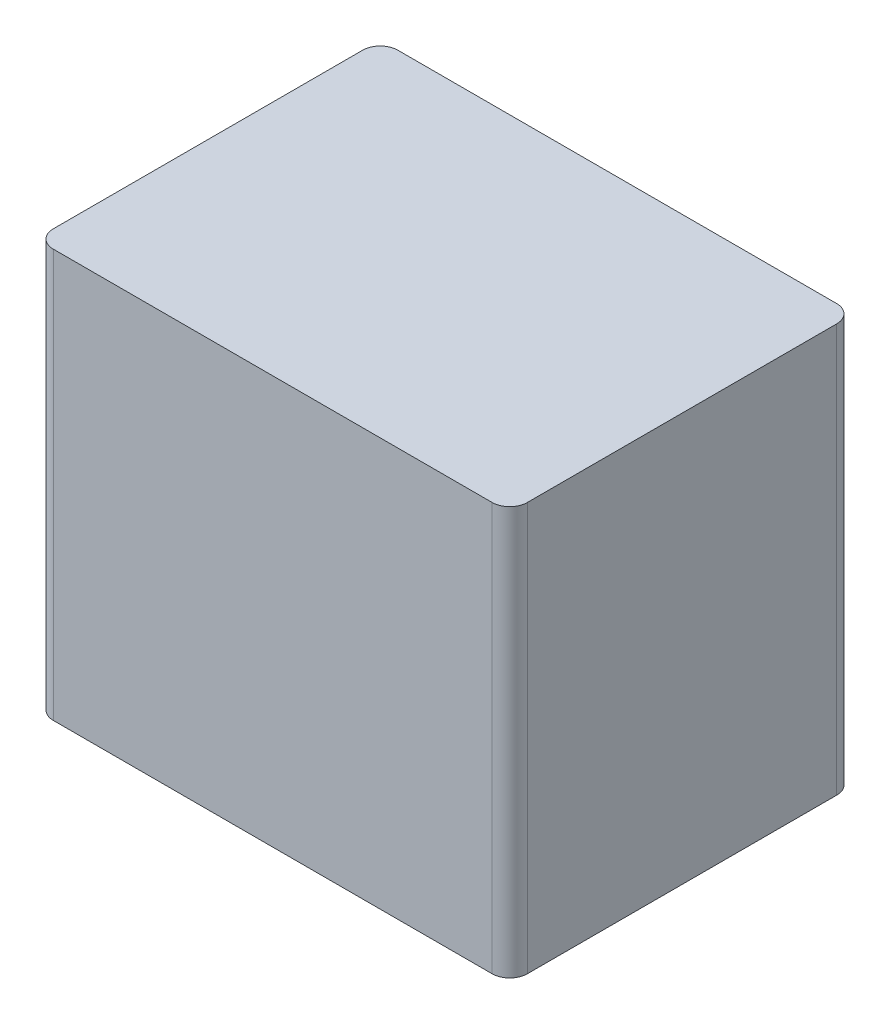
ISO-10303-21;
HEADER;
FILE_DESCRIPTION(('STEP AP214'),'2;1');
FILE_NAME('part.step','',(''),(''),'','','');
FILE_SCHEMA(('AUTOMOTIVE_DESIGN { 1 0 10303 214 1 1 1 1 }'));
ENDSEC;
DATA;
#1=APPLICATION_CONTEXT('core data for automotive mechanical design processes');
#2=APPLICATION_PROTOCOL_DEFINITION('international standard','automotive_design',2000,#1);
#3=PRODUCT_CONTEXT('',#1,'mechanical');
#4=PRODUCT('Part','Part','',(#3));
#5=PRODUCT_RELATED_PRODUCT_CATEGORY('part','',(#4));
#6=PRODUCT_DEFINITION_FORMATION('','',#4);
#7=PRODUCT_DEFINITION_CONTEXT('part definition',#1,'design');
#8=PRODUCT_DEFINITION('design','',#6,#7);
#9=PRODUCT_DEFINITION_SHAPE('','',#8);
#10=(LENGTH_UNIT() NAMED_UNIT(*) SI_UNIT(.MILLI.,.METRE.));
#11=(NAMED_UNIT(*) PLANE_ANGLE_UNIT() SI_UNIT($,.RADIAN.));
#12=(NAMED_UNIT(*) SI_UNIT($,.STERADIAN.) SOLID_ANGLE_UNIT());
#13=UNCERTAINTY_MEASURE_WITH_UNIT(LENGTH_MEASURE(1.E-05),#10,'distance_accuracy_value','');
#14=(GEOMETRIC_REPRESENTATION_CONTEXT(3) GLOBAL_UNCERTAINTY_ASSIGNED_CONTEXT((#13)) GLOBAL_UNIT_ASSIGNED_CONTEXT((#10,
#11,#12)) REPRESENTATION_CONTEXT('',''));
#15=CARTESIAN_POINT('',(0.,0.,0.));
#16=DIRECTION('',(0.,0.,1.));
#17=DIRECTION('',(1.,0.,0.));
#18=AXIS2_PLACEMENT_3D('',#15,#16,#17);
#19=CARTESIAN_POINT('',(0.,46.5,0.));
#20=DIRECTION('',(1.,0.,0.));
#21=DIRECTION('',(0.,0.,-1.));
#22=AXIS2_PLACEMENT_3D('',#19,#20,#21);
#23=PLANE('',#22);
#24=DIRECTION('',(0.,0.,1.));
#25=VECTOR('',#24,1.);
#26=CARTESIAN_POINT('',(0.,46.5,0.));
#27=LINE('',#26,#25);
#28=CARTESIAN_POINT('',(0.,46.5,-37.25));
#29=VERTEX_POINT('',#28);
#30=CARTESIAN_POINT('',(0.,46.5,-2.));
#31=VERTEX_POINT('',#30);
#32=EDGE_CURVE('E131',#29,#31,#27,.T.);
#33=ORIENTED_EDGE('',*,*,#32,.F.);
#34=DIRECTION('',(0.,-1.,0.));
#35=VECTOR('',#34,1.);
#36=CARTESIAN_POINT('',(0.,46.5,-37.25));
#37=LINE('',#36,#35);
#38=CARTESIAN_POINT('',(0.,0.,-37.25));
#39=VERTEX_POINT('',#38);
#40=EDGE_CURVE('E11',#29,#39,#37,.T.);
#41=ORIENTED_EDGE('',*,*,#40,.T.);
#42=DIRECTION('',(0.,0.,1.));
#43=VECTOR('',#42,1.);
#44=CARTESIAN_POINT('',(0.,0.,0.));
#45=LINE('',#44,#43);
#46=CARTESIAN_POINT('',(0.,0.,-2.));
#47=VERTEX_POINT('',#46);
#48=EDGE_CURVE('E122',#39,#47,#45,.T.);
#49=ORIENTED_EDGE('',*,*,#48,.T.);
#50=DIRECTION('',(0.,-1.,0.));
#51=VECTOR('',#50,1.);
#52=CARTESIAN_POINT('',(0.,46.5,-2.));
#53=LINE('',#52,#51);
#54=EDGE_CURVE('E107',#47,#31,#53,.F.);
#55=ORIENTED_EDGE('',*,*,#54,.T.);
#56=EDGE_LOOP('',(#33,#41,#49,#55));
#57=FACE_BOUND('',#56,.T.);
#58=ADVANCED_FACE('F33',(#57),#23,.F.);
#59=CARTESIAN_POINT('',(0.,46.5,0.));
#60=DIRECTION('',(0.,0.,-1.));
#61=DIRECTION('',(-1.,0.,0.));
#62=AXIS2_PLACEMENT_3D('',#59,#60,#61);
#63=PLANE('',#62);
#64=DIRECTION('',(1.,0.,0.));
#65=VECTOR('',#64,1.);
#66=CARTESIAN_POINT('',(0.,0.,0.));
#67=LINE('',#66,#65);
#68=CARTESIAN_POINT('',(2.,0.,0.));
#69=VERTEX_POINT('',#68);
#70=CARTESIAN_POINT('',(52.,0.,0.));
#71=VERTEX_POINT('',#70);
#72=EDGE_CURVE('E113',#69,#71,#67,.T.);
#73=ORIENTED_EDGE('',*,*,#72,.T.);
#74=DIRECTION('',(0.,-1.,0.));
#75=VECTOR('',#74,1.);
#76=CARTESIAN_POINT('',(52.,46.5,0.));
#77=LINE('',#76,#75);
#78=CARTESIAN_POINT('',(52.,46.5,0.));
#79=VERTEX_POINT('',#78);
#80=EDGE_CURVE('E41',#71,#79,#77,.F.);
#81=ORIENTED_EDGE('',*,*,#80,.T.);
#82=DIRECTION('',(1.,0.,0.));
#83=VECTOR('',#82,1.);
#84=CARTESIAN_POINT('',(0.,46.5,0.));
#85=LINE('',#84,#83);
#86=CARTESIAN_POINT('',(2.,46.5,0.));
#87=VERTEX_POINT('',#86);
#88=EDGE_CURVE('E114',#87,#79,#85,.T.);
#89=ORIENTED_EDGE('',*,*,#88,.F.);
#90=DIRECTION('',(0.,-1.,0.));
#91=VECTOR('',#90,1.);
#92=CARTESIAN_POINT('',(2.,46.5,0.));
#93=LINE('',#92,#91);
#94=EDGE_CURVE('E105',#87,#69,#93,.T.);
#95=ORIENTED_EDGE('',*,*,#94,.T.);
#96=EDGE_LOOP('',(#73,#81,#89,#95));
#97=FACE_BOUND('',#96,.T.);
#98=ADVANCED_FACE('F112',(#97),#63,.F.);
#99=CARTESIAN_POINT('',(54.,46.5,0.));
#100=DIRECTION('',(-1.,0.,0.));
#101=DIRECTION('',(0.,0.,1.));
#102=AXIS2_PLACEMENT_3D('',#99,#100,#101);
#103=PLANE('',#102);
#104=DIRECTION('',(0.,0.,-1.));
#105=VECTOR('',#104,1.);
#106=CARTESIAN_POINT('',(54.,0.,0.));
#107=LINE('',#106,#105);
#108=CARTESIAN_POINT('',(54.,0.,-2.));
#109=VERTEX_POINT('',#108);
#110=CARTESIAN_POINT('',(54.,0.,-37.25));
#111=VERTEX_POINT('',#110);
#112=EDGE_CURVE('E121',#109,#111,#107,.T.);
#113=ORIENTED_EDGE('',*,*,#112,.T.);
#114=DIRECTION('',(0.,-1.,0.));
#115=VECTOR('',#114,1.);
#116=CARTESIAN_POINT('',(54.,46.5,-37.25));
#117=LINE('',#116,#115);
#118=CARTESIAN_POINT('',(54.,46.5,-37.25));
#119=VERTEX_POINT('',#118);
#120=EDGE_CURVE('E149',#111,#119,#117,.F.);
#121=ORIENTED_EDGE('',*,*,#120,.T.);
#122=DIRECTION('',(0.,0.,-1.));
#123=VECTOR('',#122,1.);
#124=CARTESIAN_POINT('',(54.,46.5,0.));
#125=LINE('',#124,#123);
#126=CARTESIAN_POINT('',(54.,46.5,-2.));
#127=VERTEX_POINT('',#126);
#128=EDGE_CURVE('E160',#127,#119,#125,.T.);
#129=ORIENTED_EDGE('',*,*,#128,.F.);
#130=DIRECTION('',(0.,-1.,0.));
#131=VECTOR('',#130,1.);
#132=CARTESIAN_POINT('',(54.,46.5,-2.));
#133=LINE('',#132,#131);
#134=EDGE_CURVE('E146',#127,#109,#133,.T.);
#135=ORIENTED_EDGE('',*,*,#134,.T.);
#136=EDGE_LOOP('',(#113,#121,#129,#135));
#137=FACE_BOUND('',#136,.T.);
#138=ADVANCED_FACE('F169',(#137),#103,.F.);
#139=CARTESIAN_POINT('',(0.,46.5,-39.25));
#140=DIRECTION('',(0.,0.,1.));
#141=DIRECTION('',(1.,0.,0.));
#142=AXIS2_PLACEMENT_3D('',#139,#140,#141);
#143=PLANE('',#142);
#144=DIRECTION('',(-1.,0.,0.));
#145=VECTOR('',#144,1.);
#146=CARTESIAN_POINT('',(0.,46.5,-39.25));
#147=LINE('',#146,#145);
#148=CARTESIAN_POINT('',(52.,46.5,-39.25));
#149=VERTEX_POINT('',#148);
#150=CARTESIAN_POINT('',(2.,46.5,-39.25));
#151=VERTEX_POINT('',#150);
#152=EDGE_CURVE('E115',#149,#151,#147,.T.);
#153=ORIENTED_EDGE('',*,*,#152,.F.);
#154=DIRECTION('',(0.,-1.,0.));
#155=VECTOR('',#154,1.);
#156=CARTESIAN_POINT('',(52.,46.5,-39.25));
#157=LINE('',#156,#155);
#158=CARTESIAN_POINT('',(52.,0.,-39.25));
#159=VERTEX_POINT('',#158);
#160=EDGE_CURVE('E138',#149,#159,#157,.T.);
#161=ORIENTED_EDGE('',*,*,#160,.T.);
#162=DIRECTION('',(-1.,0.,0.));
#163=VECTOR('',#162,1.);
#164=CARTESIAN_POINT('',(0.,0.,-39.25));
#165=LINE('',#164,#163);
#166=CARTESIAN_POINT('',(2.,0.,-39.25));
#167=VERTEX_POINT('',#166);
#168=EDGE_CURVE('E125',#159,#167,#165,.T.);
#169=ORIENTED_EDGE('',*,*,#168,.T.);
#170=DIRECTION('',(0.,-1.,0.));
#171=VECTOR('',#170,1.);
#172=CARTESIAN_POINT('',(2.,46.5,-39.25));
#173=LINE('',#172,#171);
#174=EDGE_CURVE('E136',#167,#151,#173,.F.);
#175=ORIENTED_EDGE('',*,*,#174,.T.);
#176=EDGE_LOOP('',(#153,#161,#169,#175));
#177=FACE_BOUND('',#176,.T.);
#178=ADVANCED_FACE('F165',(#177),#143,.F.);
#179=CARTESIAN_POINT('',(0.,46.5,0.));
#180=DIRECTION('',(0.,-1.,0.));
#181=DIRECTION('',(0.,0.,-1.));
#182=AXIS2_PLACEMENT_3D('',#179,#180,#181);
#183=PLANE('',#182);
#184=ORIENTED_EDGE('',*,*,#128,.T.);
#185=CARTESIAN_POINT('',(52.,46.5,-37.25));
#186=DIRECTION('',(0.,-1.,0.));
#187=DIRECTION('',(0.,0.,-1.));
#188=AXIS2_PLACEMENT_3D('',#185,#186,#187);
#189=CIRCLE('',#188,2.);
#190=EDGE_CURVE('E154',#119,#149,#189,.F.);
#191=ORIENTED_EDGE('',*,*,#190,.T.);
#192=ORIENTED_EDGE('',*,*,#152,.T.);
#193=CARTESIAN_POINT('',(2.,46.5,-37.25));
#194=DIRECTION('',(0.,-1.,0.));
#195=DIRECTION('',(0.,0.,-1.));
#196=AXIS2_PLACEMENT_3D('',#193,#194,#195);
#197=CIRCLE('',#196,2.);
#198=EDGE_CURVE('E55',#151,#29,#197,.F.);
#199=ORIENTED_EDGE('',*,*,#198,.T.);
#200=ORIENTED_EDGE('',*,*,#32,.T.);
#201=CARTESIAN_POINT('',(2.,46.5,-2.));
#202=DIRECTION('',(0.,-1.,0.));
#203=DIRECTION('',(0.,0.,-1.));
#204=AXIS2_PLACEMENT_3D('',#201,#202,#203);
#205=CIRCLE('',#204,2.);
#206=EDGE_CURVE('E134',#31,#87,#205,.F.);
#207=ORIENTED_EDGE('',*,*,#206,.T.);
#208=ORIENTED_EDGE('',*,*,#88,.T.);
#209=CARTESIAN_POINT('',(52.,46.5,-2.));
#210=DIRECTION('',(0.,-1.,0.));
#211=DIRECTION('',(0.,0.,-1.));
#212=AXIS2_PLACEMENT_3D('',#209,#210,#211);
#213=CIRCLE('',#212,2.);
#214=EDGE_CURVE('E152',#79,#127,#213,.F.);
#215=ORIENTED_EDGE('',*,*,#214,.T.);
#216=EDGE_LOOP('',(#184,#191,#192,#199,#200,#207,#208,#215));
#217=FACE_BOUND('',#216,.T.);
#218=ADVANCED_FACE('F158',(#217),#183,.F.);
#219=CARTESIAN_POINT('',(0.,0.,0.));
#220=DIRECTION('',(0.,-1.,0.));
#221=DIRECTION('',(0.,0.,-1.));
#222=AXIS2_PLACEMENT_3D('',#219,#220,#221);
#223=PLANE('',#222);
#224=ORIENTED_EDGE('',*,*,#168,.F.);
#225=CARTESIAN_POINT('',(52.,0.,-37.25));
#226=DIRECTION('',(0.,-1.,0.));
#227=DIRECTION('',(0.,0.,-1.));
#228=AXIS2_PLACEMENT_3D('',#225,#226,#227);
#229=CIRCLE('',#228,2.);
#230=EDGE_CURVE('E144',#159,#111,#229,.T.);
#231=ORIENTED_EDGE('',*,*,#230,.T.);
#232=ORIENTED_EDGE('',*,*,#112,.F.);
#233=CARTESIAN_POINT('',(52.,0.,-2.));
#234=DIRECTION('',(0.,-1.,0.));
#235=DIRECTION('',(0.,0.,-1.));
#236=AXIS2_PLACEMENT_3D('',#233,#234,#235);
#237=CIRCLE('',#236,2.);
#238=EDGE_CURVE('E120',#109,#71,#237,.T.);
#239=ORIENTED_EDGE('',*,*,#238,.T.);
#240=ORIENTED_EDGE('',*,*,#72,.F.);
#241=CARTESIAN_POINT('',(2.,0.,-2.));
#242=DIRECTION('',(0.,-1.,0.));
#243=DIRECTION('',(0.,0.,-1.));
#244=AXIS2_PLACEMENT_3D('',#241,#242,#243);
#245=CIRCLE('',#244,2.);
#246=EDGE_CURVE('E101',#69,#47,#245,.T.);
#247=ORIENTED_EDGE('',*,*,#246,.T.);
#248=ORIENTED_EDGE('',*,*,#48,.F.);
#249=CARTESIAN_POINT('',(2.,0.,-37.25));
#250=DIRECTION('',(0.,-1.,0.));
#251=DIRECTION('',(0.,0.,-1.));
#252=AXIS2_PLACEMENT_3D('',#249,#250,#251);
#253=CIRCLE('',#252,2.);
#254=EDGE_CURVE('E141',#39,#167,#253,.T.);
#255=ORIENTED_EDGE('',*,*,#254,.T.);
#256=EDGE_LOOP('',(#224,#231,#232,#239,#240,#247,#248,#255));
#257=FACE_BOUND('',#256,.T.);
#258=ADVANCED_FACE('F118',(#257),#223,.T.);
#259=CARTESIAN_POINT('',(2.,46.5,-2.));
#260=DIRECTION('',(0.,-1.,0.));
#261=DIRECTION('',(0.,0.,-1.));
#262=AXIS2_PLACEMENT_3D('',#259,#260,#261);
#263=CYLINDRICAL_SURFACE('',#262,2.);
#264=ORIENTED_EDGE('',*,*,#206,.F.);
#265=ORIENTED_EDGE('',*,*,#54,.F.);
#266=ORIENTED_EDGE('',*,*,#246,.F.);
#267=ORIENTED_EDGE('',*,*,#94,.F.);
#268=EDGE_LOOP('',(#264,#265,#266,#267));
#269=FACE_BOUND('',#268,.T.);
#270=ADVANCED_FACE('F104',(#269),#263,.T.);
#271=CARTESIAN_POINT('',(52.,46.5,-37.25));
#272=DIRECTION('',(0.,-1.,0.));
#273=DIRECTION('',(0.,0.,-1.));
#274=AXIS2_PLACEMENT_3D('',#271,#272,#273);
#275=CYLINDRICAL_SURFACE('',#274,2.);
#276=ORIENTED_EDGE('',*,*,#190,.F.);
#277=ORIENTED_EDGE('',*,*,#120,.F.);
#278=ORIENTED_EDGE('',*,*,#230,.F.);
#279=ORIENTED_EDGE('',*,*,#160,.F.);
#280=EDGE_LOOP('',(#276,#277,#278,#279));
#281=FACE_BOUND('',#280,.T.);
#282=ADVANCED_FACE('F167',(#281),#275,.T.);
#283=CARTESIAN_POINT('',(52.,46.5,-2.));
#284=DIRECTION('',(0.,-1.,0.));
#285=DIRECTION('',(0.,0.,-1.));
#286=AXIS2_PLACEMENT_3D('',#283,#284,#285);
#287=CYLINDRICAL_SURFACE('',#286,2.);
#288=ORIENTED_EDGE('',*,*,#214,.F.);
#289=ORIENTED_EDGE('',*,*,#80,.F.);
#290=ORIENTED_EDGE('',*,*,#238,.F.);
#291=ORIENTED_EDGE('',*,*,#134,.F.);
#292=EDGE_LOOP('',(#288,#289,#290,#291));
#293=FACE_BOUND('',#292,.T.);
#294=ADVANCED_FACE('F173',(#293),#287,.T.);
#295=CARTESIAN_POINT('',(2.,46.5,-37.25));
#296=DIRECTION('',(0.,-1.,0.));
#297=DIRECTION('',(0.,0.,-1.));
#298=AXIS2_PLACEMENT_3D('',#295,#296,#297);
#299=CYLINDRICAL_SURFACE('',#298,2.);
#300=ORIENTED_EDGE('',*,*,#198,.F.);
#301=ORIENTED_EDGE('',*,*,#174,.F.);
#302=ORIENTED_EDGE('',*,*,#254,.F.);
#303=ORIENTED_EDGE('',*,*,#40,.F.);
#304=EDGE_LOOP('',(#300,#301,#302,#303));
#305=FACE_BOUND('',#304,.T.);
#306=ADVANCED_FACE('F35',(#305),#299,.T.);
#307=CLOSED_SHELL('',(#58,#98,#138,#178,#218,#258,#270,#282,#294,#306));
#308=MANIFOLD_SOLID_BREP('B2',#307);
#309=ADVANCED_BREP_SHAPE_REPRESENTATION('',(#18,#308),#14);
#310=SHAPE_DEFINITION_REPRESENTATION(#9,#309);
ENDSEC;
END-ISO-10303-21;
